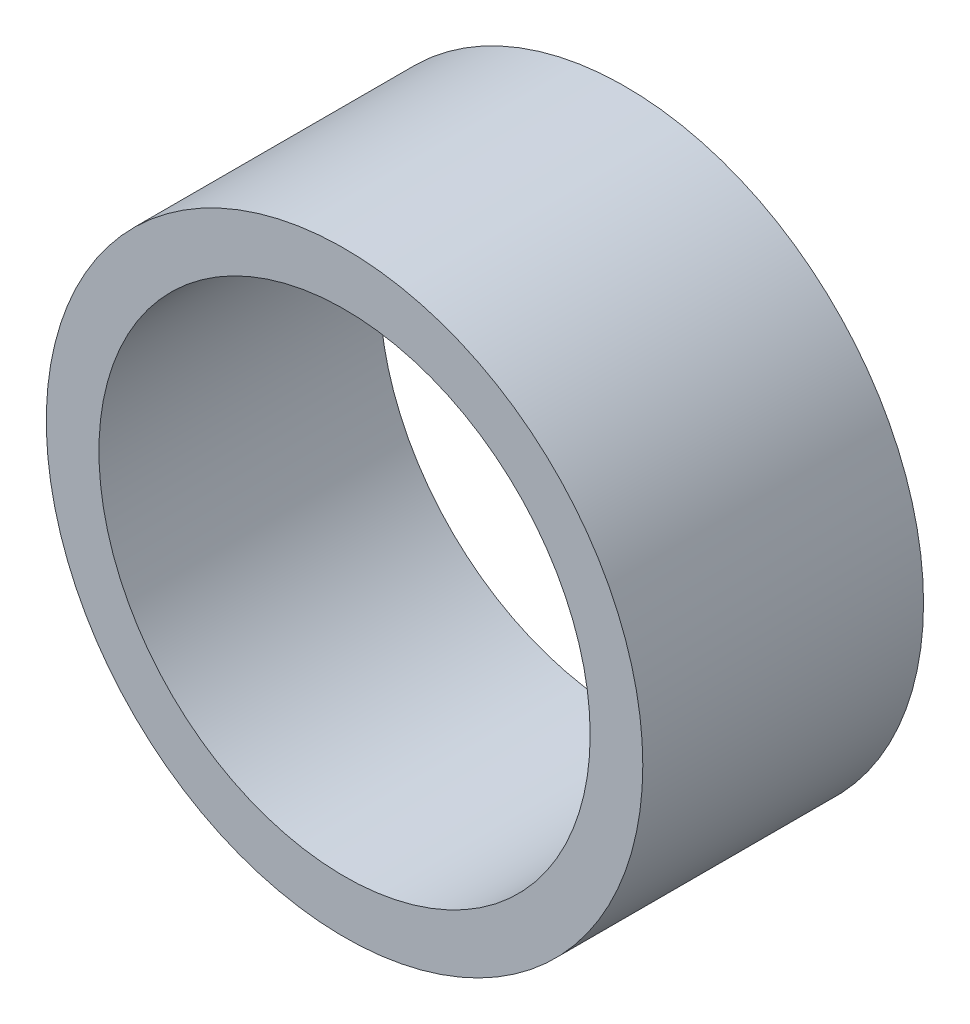
ISO-10303-21;
HEADER;
FILE_DESCRIPTION(('STEP AP214'),'2;1');
FILE_NAME('part.step','',(''),(''),'','','');
FILE_SCHEMA(('AUTOMOTIVE_DESIGN { 1 0 10303 214 1 1 1 1 }'));
ENDSEC;
DATA;
#1=APPLICATION_CONTEXT('core data for automotive mechanical design processes');
#2=APPLICATION_PROTOCOL_DEFINITION('international standard','automotive_design',2000,#1);
#3=PRODUCT_CONTEXT('',#1,'mechanical');
#4=PRODUCT('Part','Part','',(#3));
#5=PRODUCT_RELATED_PRODUCT_CATEGORY('part','',(#4));
#6=PRODUCT_DEFINITION_FORMATION('','',#4);
#7=PRODUCT_DEFINITION_CONTEXT('part definition',#1,'design');
#8=PRODUCT_DEFINITION('design','',#6,#7);
#9=PRODUCT_DEFINITION_SHAPE('','',#8);
#10=(LENGTH_UNIT() NAMED_UNIT(*) SI_UNIT(.MILLI.,.METRE.));
#11=(NAMED_UNIT(*) PLANE_ANGLE_UNIT() SI_UNIT($,.RADIAN.));
#12=(NAMED_UNIT(*) SI_UNIT($,.STERADIAN.) SOLID_ANGLE_UNIT());
#13=UNCERTAINTY_MEASURE_WITH_UNIT(LENGTH_MEASURE(1.E-05),#10,'distance_accuracy_value','');
#14=(GEOMETRIC_REPRESENTATION_CONTEXT(3) GLOBAL_UNCERTAINTY_ASSIGNED_CONTEXT((#13)) GLOBAL_UNIT_ASSIGNED_CONTEXT((#10,
#11,#12)) REPRESENTATION_CONTEXT('',''));
#15=CARTESIAN_POINT('',(0.,0.,0.));
#16=DIRECTION('',(0.,0.,1.));
#17=DIRECTION('',(1.,0.,0.));
#18=AXIS2_PLACEMENT_3D('',#15,#16,#17);
#19=CARTESIAN_POINT('',(0.,0.,8.));
#20=DIRECTION('',(0.,0.,1.));
#21=DIRECTION('',(1.,0.,0.));
#22=AXIS2_PLACEMENT_3D('',#19,#20,#21);
#23=PLANE('',#22);
#24=CARTESIAN_POINT('',(0.,0.,8.));
#25=DIRECTION('',(0.,0.,1.));
#26=DIRECTION('',(1.,0.,0.));
#27=AXIS2_PLACEMENT_3D('',#24,#25,#26);
#28=CIRCLE('',#27,8.5);
#29=CARTESIAN_POINT('',(8.5,0.,8.));
#30=VERTEX_POINT('',#29);
#31=EDGE_CURVE('E11',#30,#30,#28,.T.);
#32=ORIENTED_EDGE('',*,*,#31,.T.);
#33=EDGE_LOOP('',(#32));
#34=FACE_BOUND('',#33,.T.);
#35=CARTESIAN_POINT('',(0.,0.,8.));
#36=DIRECTION('',(0.,0.,1.));
#37=DIRECTION('',(1.,0.,0.));
#38=AXIS2_PLACEMENT_3D('',#35,#36,#37);
#39=CIRCLE('',#38,7.);
#40=CARTESIAN_POINT('',(7.,0.,8.));
#41=VERTEX_POINT('',#40);
#42=EDGE_CURVE('E54',#41,#41,#39,.T.);
#43=ORIENTED_EDGE('',*,*,#42,.F.);
#44=EDGE_LOOP('',(#43));
#45=FACE_BOUND('',#44,.T.);
#46=ADVANCED_FACE('F43',(#34,#45),#23,.T.);
#47=CARTESIAN_POINT('',(0.,0.,0.));
#48=DIRECTION('',(0.,0.,1.));
#49=DIRECTION('',(1.,0.,0.));
#50=AXIS2_PLACEMENT_3D('',#47,#48,#49);
#51=PLANE('',#50);
#52=CARTESIAN_POINT('',(0.,0.,0.));
#53=DIRECTION('',(0.,0.,1.));
#54=DIRECTION('',(1.,0.,0.));
#55=AXIS2_PLACEMENT_3D('',#52,#53,#54);
#56=CIRCLE('',#55,8.5);
#57=CARTESIAN_POINT('',(8.5,0.,0.));
#58=VERTEX_POINT('',#57);
#59=EDGE_CURVE('E47',#58,#58,#56,.T.);
#60=ORIENTED_EDGE('',*,*,#59,.F.);
#61=EDGE_LOOP('',(#60));
#62=FACE_BOUND('',#61,.T.);
#63=CARTESIAN_POINT('',(0.,0.,0.));
#64=DIRECTION('',(0.,0.,1.));
#65=DIRECTION('',(1.,0.,0.));
#66=AXIS2_PLACEMENT_3D('',#63,#64,#65);
#67=CIRCLE('',#66,7.);
#68=CARTESIAN_POINT('',(7.,0.,0.));
#69=VERTEX_POINT('',#68);
#70=EDGE_CURVE('E56',#69,#69,#67,.T.);
#71=ORIENTED_EDGE('',*,*,#70,.T.);
#72=EDGE_LOOP('',(#71));
#73=FACE_BOUND('',#72,.T.);
#74=ADVANCED_FACE('F66',(#62,#73),#51,.F.);
#75=CARTESIAN_POINT('',(0.,0.,8.));
#76=DIRECTION('',(0.,0.,-1.));
#77=DIRECTION('',(-1.,0.,0.));
#78=AXIS2_PLACEMENT_3D('',#75,#76,#77);
#79=CYLINDRICAL_SURFACE('',#78,8.5);
#80=ORIENTED_EDGE('',*,*,#31,.F.);
#81=EDGE_LOOP('',(#80));
#82=FACE_BOUND('',#81,.T.);
#83=ORIENTED_EDGE('',*,*,#59,.T.);
#84=EDGE_LOOP('',(#83));
#85=FACE_BOUND('',#84,.T.);
#86=ADVANCED_FACE('F45',(#82,#85),#79,.T.);
#87=CARTESIAN_POINT('',(0.,0.,8.));
#88=DIRECTION('',(0.,0.,-1.));
#89=DIRECTION('',(-1.,0.,0.));
#90=AXIS2_PLACEMENT_3D('',#87,#88,#89);
#91=CYLINDRICAL_SURFACE('',#90,7.);
#92=ORIENTED_EDGE('',*,*,#42,.T.);
#93=EDGE_LOOP('',(#92));
#94=FACE_BOUND('',#93,.T.);
#95=ORIENTED_EDGE('',*,*,#70,.F.);
#96=EDGE_LOOP('',(#95));
#97=FACE_BOUND('',#96,.T.);
#98=ADVANCED_FACE('F62',(#94,#97),#91,.F.);
#99=CLOSED_SHELL('',(#46,#74,#86,#98));
#100=MANIFOLD_SOLID_BREP('B2',#99);
#101=ADVANCED_BREP_SHAPE_REPRESENTATION('',(#18,#100),#14);
#102=SHAPE_DEFINITION_REPRESENTATION(#9,#101);
ENDSEC;
END-ISO-10303-21;
